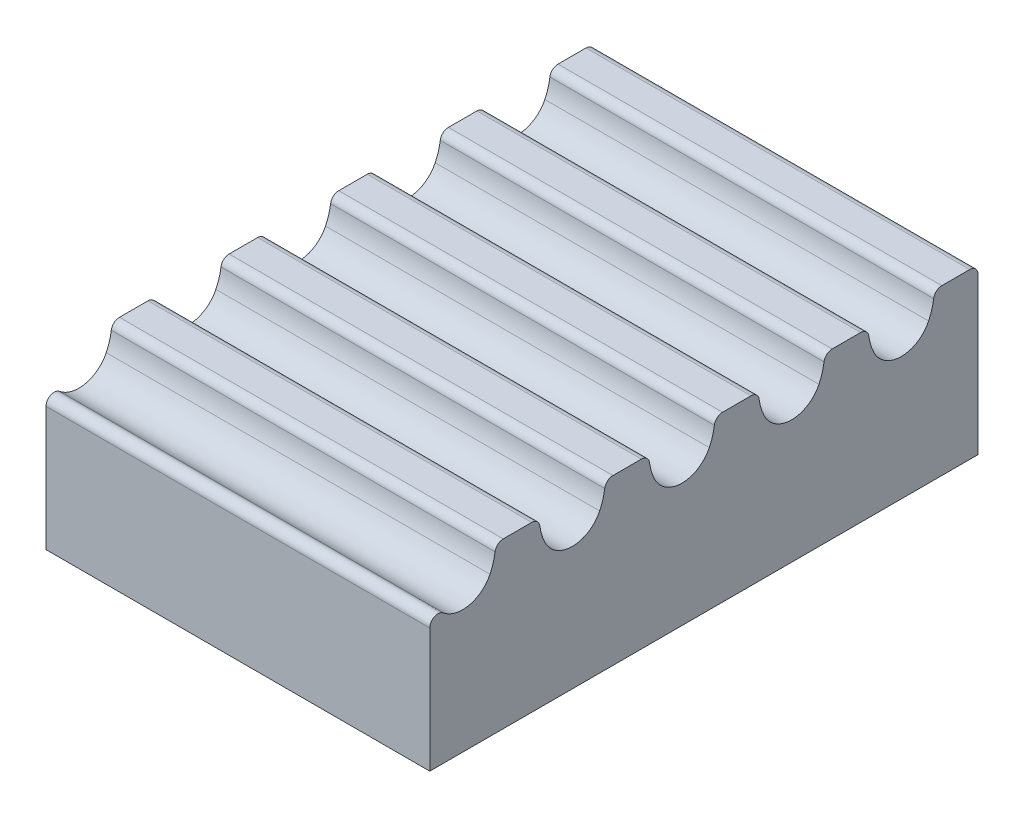
ISO-10303-21;
HEADER;
FILE_DESCRIPTION(('STEP AP214'),'2;1');
FILE_NAME('part.step','',(''),(''),'','','');
FILE_SCHEMA(('AUTOMOTIVE_DESIGN { 1 0 10303 214 1 1 1 1 }'));
ENDSEC;
DATA;
#1=APPLICATION_CONTEXT('core data for automotive mechanical design processes');
#2=APPLICATION_PROTOCOL_DEFINITION('international standard','automotive_design',2000,#1);
#3=PRODUCT_CONTEXT('',#1,'mechanical');
#4=PRODUCT('Part','Part','',(#3));
#5=PRODUCT_RELATED_PRODUCT_CATEGORY('part','',(#4));
#6=PRODUCT_DEFINITION_FORMATION('','',#4);
#7=PRODUCT_DEFINITION_CONTEXT('part definition',#1,'design');
#8=PRODUCT_DEFINITION('design','',#6,#7);
#9=PRODUCT_DEFINITION_SHAPE('','',#8);
#10=(LENGTH_UNIT() NAMED_UNIT(*) SI_UNIT(.MILLI.,.METRE.));
#11=(NAMED_UNIT(*) PLANE_ANGLE_UNIT() SI_UNIT($,.RADIAN.));
#12=(NAMED_UNIT(*) SI_UNIT($,.STERADIAN.) SOLID_ANGLE_UNIT());
#13=UNCERTAINTY_MEASURE_WITH_UNIT(LENGTH_MEASURE(1.E-05),#10,'distance_accuracy_value','');
#14=(GEOMETRIC_REPRESENTATION_CONTEXT(3) GLOBAL_UNCERTAINTY_ASSIGNED_CONTEXT((#13)) GLOBAL_UNIT_ASSIGNED_CONTEXT((#10,
#11,#12)) REPRESENTATION_CONTEXT('',''));
#15=CARTESIAN_POINT('',(0.,0.,0.));
#16=DIRECTION('',(0.,0.,1.));
#17=DIRECTION('',(1.,0.,0.));
#18=AXIS2_PLACEMENT_3D('',#15,#16,#17);
#19=CARTESIAN_POINT('',(7.,0.,0.));
#20=DIRECTION('',(0.,-1.,0.));
#21=DIRECTION('',(0.,0.,-1.));
#22=AXIS2_PLACEMENT_3D('',#19,#20,#21);
#23=PLANE('',#22);
#24=DIRECTION('',(0.,0.,1.));
#25=VECTOR('',#24,1.);
#26=CARTESIAN_POINT('',(7.,0.,0.));
#27=LINE('',#26,#25);
#28=CARTESIAN_POINT('',(7.,0.,-1.85982457490086));
#29=VERTEX_POINT('',#28);
#30=CARTESIAN_POINT('',(7.,0.,-1.34017542509914));
#31=VERTEX_POINT('',#30);
#32=EDGE_CURVE('E366',#29,#31,#27,.T.);
#33=ORIENTED_EDGE('',*,*,#32,.F.);
#34=DIRECTION('',(1.,0.,0.));
#35=VECTOR('',#34,1.);
#36=CARTESIAN_POINT('',(0.,0.,-1.85982457490086));
#37=LINE('',#36,#35);
#38=CARTESIAN_POINT('',(0.,0.,-1.85982457490086));
#39=VERTEX_POINT('',#38);
#40=EDGE_CURVE('E472',#29,#39,#37,.F.);
#41=ORIENTED_EDGE('',*,*,#40,.T.);
#42=DIRECTION('',(0.,0.,1.));
#43=VECTOR('',#42,1.);
#44=CARTESIAN_POINT('',(0.,0.,0.));
#45=LINE('',#44,#43);
#46=CARTESIAN_POINT('',(0.,0.,-1.34017542509914));
#47=VERTEX_POINT('',#46);
#48=EDGE_CURVE('E377',#39,#47,#45,.T.);
#49=ORIENTED_EDGE('',*,*,#48,.T.);
#50=DIRECTION('',(1.,0.,0.));
#51=VECTOR('',#50,1.);
#52=CARTESIAN_POINT('',(7.,0.,-1.34017542509914));
#53=LINE('',#52,#51);
#54=EDGE_CURVE('E470',#47,#31,#53,.T.);
#55=ORIENTED_EDGE('',*,*,#54,.T.);
#56=EDGE_LOOP('',(#33,#41,#49,#55));
#57=FACE_BOUND('',#56,.T.);
#58=ADVANCED_FACE('F36',(#57),#23,.F.);
#59=CARTESIAN_POINT('',(7.,0.,-3.85982457490086));
#60=VERTEX_POINT('',#59);
#61=CARTESIAN_POINT('',(7.,0.,-3.34017542509914));
#62=VERTEX_POINT('',#61);
#63=EDGE_CURVE('E367',#60,#62,#27,.T.);
#64=ORIENTED_EDGE('',*,*,#63,.F.);
#65=DIRECTION('',(1.,0.,0.));
#66=VECTOR('',#65,1.);
#67=CARTESIAN_POINT('',(0.,0.,-3.85982457490086));
#68=LINE('',#67,#66);
#69=CARTESIAN_POINT('',(0.,0.,-3.85982457490086));
#70=VERTEX_POINT('',#69);
#71=EDGE_CURVE('E462',#60,#70,#68,.F.);
#72=ORIENTED_EDGE('',*,*,#71,.T.);
#73=CARTESIAN_POINT('',(0.,0.,-3.34017542509914));
#74=VERTEX_POINT('',#73);
#75=EDGE_CURVE('E380',#70,#74,#45,.T.);
#76=ORIENTED_EDGE('',*,*,#75,.T.);
#77=DIRECTION('',(1.,0.,0.));
#78=VECTOR('',#77,1.);
#79=CARTESIAN_POINT('',(7.,0.,-3.34017542509914));
#80=LINE('',#79,#78);
#81=EDGE_CURVE('E59',#74,#62,#80,.T.);
#82=ORIENTED_EDGE('',*,*,#81,.T.);
#83=EDGE_LOOP('',(#64,#72,#76,#82));
#84=FACE_BOUND('',#83,.T.);
#85=ADVANCED_FACE('F555',(#84),#23,.F.);
#86=CARTESIAN_POINT('',(7.,0.,-5.85982457490086));
#87=VERTEX_POINT('',#86);
#88=CARTESIAN_POINT('',(7.,0.,-5.34017542509914));
#89=VERTEX_POINT('',#88);
#90=EDGE_CURVE('E369',#87,#89,#27,.T.);
#91=ORIENTED_EDGE('',*,*,#90,.F.);
#92=DIRECTION('',(1.,0.,0.));
#93=VECTOR('',#92,1.);
#94=CARTESIAN_POINT('',(0.,0.,-5.85982457490086));
#95=LINE('',#94,#93);
#96=CARTESIAN_POINT('',(0.,0.,-5.85982457490086));
#97=VERTEX_POINT('',#96);
#98=EDGE_CURVE('E453',#87,#97,#95,.F.);
#99=ORIENTED_EDGE('',*,*,#98,.T.);
#100=CARTESIAN_POINT('',(0.,0.,-5.34017542509914));
#101=VERTEX_POINT('',#100);
#102=EDGE_CURVE('E556',#97,#101,#45,.T.);
#103=ORIENTED_EDGE('',*,*,#102,.T.);
#104=DIRECTION('',(1.,0.,0.));
#105=VECTOR('',#104,1.);
#106=CARTESIAN_POINT('',(7.,0.,-5.34017542509914));
#107=LINE('',#106,#105);
#108=EDGE_CURVE('E451',#101,#89,#107,.T.);
#109=ORIENTED_EDGE('',*,*,#108,.T.);
#110=EDGE_LOOP('',(#91,#99,#103,#109));
#111=FACE_BOUND('',#110,.T.);
#112=ADVANCED_FACE('F583',(#111),#23,.F.);
#113=CARTESIAN_POINT('',(7.,0.,-7.85982457490086));
#114=VERTEX_POINT('',#113);
#115=CARTESIAN_POINT('',(7.,0.,-7.34017542509914));
#116=VERTEX_POINT('',#115);
#117=EDGE_CURVE('E518',#114,#116,#27,.T.);
#118=ORIENTED_EDGE('',*,*,#117,.F.);
#119=DIRECTION('',(1.,0.,0.));
#120=VECTOR('',#119,1.);
#121=CARTESIAN_POINT('',(0.,0.,-7.85982457490086));
#122=LINE('',#121,#120);
#123=CARTESIAN_POINT('',(0.,0.,-7.85982457490086));
#124=VERTEX_POINT('',#123);
#125=EDGE_CURVE('E443',#114,#124,#122,.F.);
#126=ORIENTED_EDGE('',*,*,#125,.T.);
#127=CARTESIAN_POINT('',(0.,0.,-7.34017542509914));
#128=VERTEX_POINT('',#127);
#129=EDGE_CURVE('E381',#124,#128,#45,.T.);
#130=ORIENTED_EDGE('',*,*,#129,.T.);
#131=DIRECTION('',(1.,0.,0.));
#132=VECTOR('',#131,1.);
#133=CARTESIAN_POINT('',(7.,0.,-7.34017542509914));
#134=LINE('',#133,#132);
#135=EDGE_CURVE('E441',#128,#116,#134,.T.);
#136=ORIENTED_EDGE('',*,*,#135,.T.);
#137=EDGE_LOOP('',(#118,#126,#130,#136));
#138=FACE_BOUND('',#137,.T.);
#139=ADVANCED_FACE('F564',(#138),#23,.F.);
#140=CARTESIAN_POINT('',(7.,0.,-9.85));
#141=VERTEX_POINT('',#140);
#142=CARTESIAN_POINT('',(7.,0.,-9.34017542509914));
#143=VERTEX_POINT('',#142);
#144=EDGE_CURVE('E370',#141,#143,#27,.T.);
#145=ORIENTED_EDGE('',*,*,#144,.F.);
#146=DIRECTION('',(-1.,0.,0.));
#147=VECTOR('',#146,1.);
#148=CARTESIAN_POINT('',(7.,0.,-9.85));
#149=LINE('',#148,#147);
#150=CARTESIAN_POINT('',(0.,0.,-9.85));
#151=VERTEX_POINT('',#150);
#152=EDGE_CURVE('E390',#141,#151,#149,.T.);
#153=ORIENTED_EDGE('',*,*,#152,.T.);
#154=CARTESIAN_POINT('',(0.,0.,-9.34017542509914));
#155=VERTEX_POINT('',#154);
#156=EDGE_CURVE('E362',#151,#155,#45,.T.);
#157=ORIENTED_EDGE('',*,*,#156,.T.);
#158=DIRECTION('',(1.,0.,0.));
#159=VECTOR('',#158,1.);
#160=CARTESIAN_POINT('',(7.,0.,-9.34017542509914));
#161=LINE('',#160,#159);
#162=EDGE_CURVE('E388',#155,#143,#161,.T.);
#163=ORIENTED_EDGE('',*,*,#162,.T.);
#164=EDGE_LOOP('',(#145,#153,#157,#163));
#165=FACE_BOUND('',#164,.T.);
#166=ADVANCED_FACE('F599',(#165),#23,.F.);
#167=CARTESIAN_POINT('',(7.,0.,0.));
#168=DIRECTION('',(0.,0.,-1.));
#169=DIRECTION('',(0.,1.,0.));
#170=AXIS2_PLACEMENT_3D('',#167,#168,#169);
#171=PLANE('',#170);
#172=DIRECTION('',(0.,-1.,0.));
#173=VECTOR('',#172,1.);
#174=CARTESIAN_POINT('',(7.,0.,0.));
#175=LINE('',#174,#173);
#176=CARTESIAN_POINT('',(7.,-0.737701575453767,0.));
#177=VERTEX_POINT('',#176);
#178=CARTESIAN_POINT('',(7.,-3.,0.));
#179=VERTEX_POINT('',#178);
#180=EDGE_CURVE('E359',#177,#179,#175,.T.);
#181=ORIENTED_EDGE('',*,*,#180,.F.);
#182=DIRECTION('',(1.,0.,0.));
#183=VECTOR('',#182,1.);
#184=CARTESIAN_POINT('',(0.,-0.737701575453767,0.));
#185=LINE('',#184,#183);
#186=CARTESIAN_POINT('',(0.,-0.737701575453767,0.));
#187=VERTEX_POINT('',#186);
#188=EDGE_CURVE('E44',#177,#187,#185,.F.);
#189=ORIENTED_EDGE('',*,*,#188,.T.);
#190=DIRECTION('',(0.,-1.,0.));
#191=VECTOR('',#190,1.);
#192=CARTESIAN_POINT('',(0.,0.,0.));
#193=LINE('',#192,#191);
#194=CARTESIAN_POINT('',(0.,-3.,0.));
#195=VERTEX_POINT('',#194);
#196=EDGE_CURVE('E358',#187,#195,#193,.T.);
#197=ORIENTED_EDGE('',*,*,#196,.T.);
#198=DIRECTION('',(-1.,0.,0.));
#199=VECTOR('',#198,1.);
#200=CARTESIAN_POINT('',(7.,-3.,0.));
#201=LINE('',#200,#199);
#202=EDGE_CURVE('E385',#179,#195,#201,.T.);
#203=ORIENTED_EDGE('',*,*,#202,.F.);
#204=EDGE_LOOP('',(#181,#189,#197,#203));
#205=FACE_BOUND('',#204,.T.);
#206=ADVANCED_FACE('F483',(#205),#171,.F.);
#207=CARTESIAN_POINT('',(7.,-3.,0.));
#208=DIRECTION('',(0.,1.,0.));
#209=DIRECTION('',(0.,0.,1.));
#210=AXIS2_PLACEMENT_3D('',#207,#208,#209);
#211=PLANE('',#210);
#212=DIRECTION('',(0.,0.,-1.));
#213=VECTOR('',#212,1.);
#214=CARTESIAN_POINT('',(0.,-3.,0.));
#215=LINE('',#214,#213);
#216=CARTESIAN_POINT('',(0.,-3.,-10.));
#217=VERTEX_POINT('',#216);
#218=EDGE_CURVE('E372',#195,#217,#215,.T.);
#219=ORIENTED_EDGE('',*,*,#218,.T.);
#220=DIRECTION('',(-1.,0.,0.));
#221=VECTOR('',#220,1.);
#222=CARTESIAN_POINT('',(7.,-3.,-10.));
#223=LINE('',#222,#221);
#224=CARTESIAN_POINT('',(7.,-3.,-10.));
#225=VERTEX_POINT('',#224);
#226=EDGE_CURVE('E382',#225,#217,#223,.T.);
#227=ORIENTED_EDGE('',*,*,#226,.F.);
#228=DIRECTION('',(0.,0.,-1.));
#229=VECTOR('',#228,1.);
#230=CARTESIAN_POINT('',(7.,-3.,0.));
#231=LINE('',#230,#229);
#232=EDGE_CURVE('E361',#179,#225,#231,.T.);
#233=ORIENTED_EDGE('',*,*,#232,.F.);
#234=ORIENTED_EDGE('',*,*,#202,.T.);
#235=EDGE_LOOP('',(#219,#227,#233,#234));
#236=FACE_BOUND('',#235,.T.);
#237=ADVANCED_FACE('F496',(#236),#211,.F.);
#238=CARTESIAN_POINT('',(7.,0.,-10.));
#239=DIRECTION('',(0.,0.,1.));
#240=DIRECTION('',(1.,0.,0.));
#241=AXIS2_PLACEMENT_3D('',#238,#239,#240);
#242=PLANE('',#241);
#243=DIRECTION('',(0.,1.,0.));
#244=VECTOR('',#243,1.);
#245=CARTESIAN_POINT('',(0.,0.,-10.));
#246=LINE('',#245,#244);
#247=CARTESIAN_POINT('',(0.,-0.15,-10.));
#248=VERTEX_POINT('',#247);
#249=EDGE_CURVE('E374',#217,#248,#246,.T.);
#250=ORIENTED_EDGE('',*,*,#249,.T.);
#251=DIRECTION('',(-1.,0.,0.));
#252=VECTOR('',#251,1.);
#253=CARTESIAN_POINT('',(7.,-0.15,-10.));
#254=LINE('',#253,#252);
#255=CARTESIAN_POINT('',(7.,-0.15,-10.));
#256=VERTEX_POINT('',#255);
#257=EDGE_CURVE('E415',#248,#256,#254,.F.);
#258=ORIENTED_EDGE('',*,*,#257,.T.);
#259=DIRECTION('',(0.,1.,0.));
#260=VECTOR('',#259,1.);
#261=CARTESIAN_POINT('',(7.,0.,-10.));
#262=LINE('',#261,#260);
#263=EDGE_CURVE('E364',#225,#256,#262,.T.);
#264=ORIENTED_EDGE('',*,*,#263,.F.);
#265=ORIENTED_EDGE('',*,*,#226,.T.);
#266=EDGE_LOOP('',(#250,#258,#264,#265));
#267=FACE_BOUND('',#266,.T.);
#268=ADVANCED_FACE('F618',(#267),#242,.F.);
#269=CARTESIAN_POINT('',(7.,0.,0.));
#270=DIRECTION('',(1.,0.,0.));
#271=DIRECTION('',(0.,0.,-1.));
#272=AXIS2_PLACEMENT_3D('',#269,#270,#271);
#273=PLANE('',#272);
#274=ORIENTED_EDGE('',*,*,#263,.T.);
#275=CARTESIAN_POINT('',(7.,-0.15,-9.85));
#276=DIRECTION('',(1.,0.,0.));
#277=DIRECTION('',(0.,0.,-1.));
#278=AXIS2_PLACEMENT_3D('',#275,#276,#277);
#279=CIRCLE('',#278,0.15);
#280=EDGE_CURVE('E436',#256,#141,#279,.T.);
#281=ORIENTED_EDGE('',*,*,#280,.T.);
#282=ORIENTED_EDGE('',*,*,#144,.T.);
#283=CARTESIAN_POINT('',(7.,-0.15,-9.34017542509914));
#284=DIRECTION('',(1.,0.,0.));
#285=DIRECTION('',(0.,0.,-1.));
#286=AXIS2_PLACEMENT_3D('',#283,#284,#285);
#287=CIRCLE('',#286,0.15);
#288=CARTESIAN_POINT('',(7.,-0.130434782608696,-9.19145689139056));
#289=VERTEX_POINT('',#288);
#290=EDGE_CURVE('E434',#143,#289,#287,.T.);
#291=ORIENTED_EDGE('',*,*,#290,.T.);
#292=CARTESIAN_POINT('',(7.,0.,-8.2));
#293=DIRECTION('',(1.,0.,0.));
#294=DIRECTION('',(0.,0.,-1.));
#295=AXIS2_PLACEMENT_3D('',#292,#293,#294);
#296=CIRCLE('',#295,1.);
#297=CARTESIAN_POINT('',(7.,-0.438202247191011,-9.09887640449438));
#298=VERTEX_POINT('',#297);
#299=EDGE_CURVE('E332',#298,#289,#296,.T.);
#300=ORIENTED_EDGE('',*,*,#299,.F.);
#301=CARTESIAN_POINT('',(7.,-0.195,-8.6));
#302=DIRECTION('',(1.,0.,0.));
#303=DIRECTION('',(0.,0.,-1.));
#304=AXIS2_PLACEMENT_3D('',#301,#302,#303);
#305=CIRCLE('',#304,0.555);
#306=CARTESIAN_POINT('',(7.,-0.438202247191011,-8.10112359550562));
#307=VERTEX_POINT('',#306);
#308=EDGE_CURVE('E329',#307,#298,#305,.T.);
#309=ORIENTED_EDGE('',*,*,#308,.F.);
#310=CARTESIAN_POINT('',(7.,0.,-9.));
#311=DIRECTION('',(1.,0.,0.));
#312=DIRECTION('',(0.,0.,-1.));
#313=AXIS2_PLACEMENT_3D('',#310,#311,#312);
#314=CIRCLE('',#313,1.);
#315=CARTESIAN_POINT('',(7.,-0.130434782608696,-8.00854310860945));
#316=VERTEX_POINT('',#315);
#317=EDGE_CURVE('E327',#316,#307,#314,.T.);
#318=ORIENTED_EDGE('',*,*,#317,.F.);
#319=CARTESIAN_POINT('',(7.,-0.15,-7.85982457490086));
#320=DIRECTION('',(1.,0.,0.));
#321=DIRECTION('',(0.,0.,-1.));
#322=AXIS2_PLACEMENT_3D('',#319,#320,#321);
#323=CIRCLE('',#322,0.15);
#324=EDGE_CURVE('E432',#316,#114,#323,.T.);
#325=ORIENTED_EDGE('',*,*,#324,.T.);
#326=ORIENTED_EDGE('',*,*,#117,.T.);
#327=CARTESIAN_POINT('',(7.,-0.15,-7.34017542509914));
#328=DIRECTION('',(1.,0.,0.));
#329=DIRECTION('',(0.,0.,-1.));
#330=AXIS2_PLACEMENT_3D('',#327,#328,#329);
#331=CIRCLE('',#330,0.15);
#332=CARTESIAN_POINT('',(7.,-0.130434782608696,-7.19145689139055));
#333=VERTEX_POINT('',#332);
#334=EDGE_CURVE('E430',#116,#333,#331,.T.);
#335=ORIENTED_EDGE('',*,*,#334,.T.);
#336=CARTESIAN_POINT('',(7.,0.,-6.2));
#337=DIRECTION('',(1.,0.,0.));
#338=DIRECTION('',(0.,0.,-1.));
#339=AXIS2_PLACEMENT_3D('',#336,#337,#338);
#340=CIRCLE('',#339,1.);
#341=CARTESIAN_POINT('',(7.,-0.438202247191011,-7.09887640449438));
#342=VERTEX_POINT('',#341);
#343=EDGE_CURVE('E312',#342,#333,#340,.T.);
#344=ORIENTED_EDGE('',*,*,#343,.F.);
#345=CARTESIAN_POINT('',(7.,-0.195,-6.6));
#346=DIRECTION('',(1.,0.,0.));
#347=DIRECTION('',(0.,0.,-1.));
#348=AXIS2_PLACEMENT_3D('',#345,#346,#347);
#349=CIRCLE('',#348,0.555);
#350=CARTESIAN_POINT('',(7.,-0.438202247191011,-6.10112359550562));
#351=VERTEX_POINT('',#350);
#352=EDGE_CURVE('E309',#351,#342,#349,.T.);
#353=ORIENTED_EDGE('',*,*,#352,.F.);
#354=CARTESIAN_POINT('',(7.,0.,-7.));
#355=DIRECTION('',(1.,0.,0.));
#356=DIRECTION('',(0.,0.,-1.));
#357=AXIS2_PLACEMENT_3D('',#354,#355,#356);
#358=CIRCLE('',#357,1.);
#359=CARTESIAN_POINT('',(7.,-0.130434782608696,-6.00854310860944));
#360=VERTEX_POINT('',#359);
#361=EDGE_CURVE('E307',#360,#351,#358,.T.);
#362=ORIENTED_EDGE('',*,*,#361,.F.);
#363=CARTESIAN_POINT('',(7.,-0.15,-5.85982457490086));
#364=DIRECTION('',(1.,0.,0.));
#365=DIRECTION('',(0.,0.,-1.));
#366=AXIS2_PLACEMENT_3D('',#363,#364,#365);
#367=CIRCLE('',#366,0.15);
#368=EDGE_CURVE('E428',#360,#87,#367,.T.);
#369=ORIENTED_EDGE('',*,*,#368,.T.);
#370=ORIENTED_EDGE('',*,*,#90,.T.);
#371=CARTESIAN_POINT('',(7.,-0.15,-5.34017542509914));
#372=DIRECTION('',(1.,0.,0.));
#373=DIRECTION('',(0.,0.,-1.));
#374=AXIS2_PLACEMENT_3D('',#371,#372,#373);
#375=CIRCLE('',#374,0.15);
#376=CARTESIAN_POINT('',(7.,-0.130434782608696,-5.19145689139055));
#377=VERTEX_POINT('',#376);
#378=EDGE_CURVE('E426',#89,#377,#375,.T.);
#379=ORIENTED_EDGE('',*,*,#378,.T.);
#380=CARTESIAN_POINT('',(7.,0.,-4.2));
#381=DIRECTION('',(1.,0.,0.));
#382=DIRECTION('',(0.,0.,-1.));
#383=AXIS2_PLACEMENT_3D('',#380,#381,#382);
#384=CIRCLE('',#383,1.);
#385=CARTESIAN_POINT('',(7.,-0.438202247191011,-5.09887640449438));
#386=VERTEX_POINT('',#385);
#387=EDGE_CURVE('E292',#386,#377,#384,.T.);
#388=ORIENTED_EDGE('',*,*,#387,.F.);
#389=CARTESIAN_POINT('',(7.,-0.195,-4.6));
#390=DIRECTION('',(1.,0.,0.));
#391=DIRECTION('',(0.,0.,-1.));
#392=AXIS2_PLACEMENT_3D('',#389,#390,#391);
#393=CIRCLE('',#392,0.555);
#394=CARTESIAN_POINT('',(7.,-0.438202247191011,-4.10112359550562));
#395=VERTEX_POINT('',#394);
#396=EDGE_CURVE('E289',#395,#386,#393,.T.);
#397=ORIENTED_EDGE('',*,*,#396,.F.);
#398=CARTESIAN_POINT('',(7.,0.,-5.));
#399=DIRECTION('',(1.,0.,0.));
#400=DIRECTION('',(0.,0.,-1.));
#401=AXIS2_PLACEMENT_3D('',#398,#399,#400);
#402=CIRCLE('',#401,1.);
#403=CARTESIAN_POINT('',(7.,-0.130434782608696,-4.00854310860944));
#404=VERTEX_POINT('',#403);
#405=EDGE_CURVE('E287',#404,#395,#402,.T.);
#406=ORIENTED_EDGE('',*,*,#405,.F.);
#407=CARTESIAN_POINT('',(7.,-0.15,-3.85982457490086));
#408=DIRECTION('',(1.,0.,0.));
#409=DIRECTION('',(0.,0.,-1.));
#410=AXIS2_PLACEMENT_3D('',#407,#408,#409);
#411=CIRCLE('',#410,0.15);
#412=EDGE_CURVE('E424',#404,#60,#411,.T.);
#413=ORIENTED_EDGE('',*,*,#412,.T.);
#414=ORIENTED_EDGE('',*,*,#63,.T.);
#415=CARTESIAN_POINT('',(7.,-0.15,-3.34017542509914));
#416=DIRECTION('',(1.,0.,0.));
#417=DIRECTION('',(0.,0.,-1.));
#418=AXIS2_PLACEMENT_3D('',#415,#416,#417);
#419=CIRCLE('',#418,0.15);
#420=CARTESIAN_POINT('',(7.,-0.130434782608696,-3.19145689139055));
#421=VERTEX_POINT('',#420);
#422=EDGE_CURVE('E51',#62,#421,#419,.T.);
#423=ORIENTED_EDGE('',*,*,#422,.T.);
#424=CARTESIAN_POINT('',(7.,0.,-2.2));
#425=DIRECTION('',(1.,0.,0.));
#426=DIRECTION('',(0.,0.,-1.));
#427=AXIS2_PLACEMENT_3D('',#424,#425,#426);
#428=CIRCLE('',#427,1.);
#429=CARTESIAN_POINT('',(7.,-0.438202247191011,-3.09887640449438));
#430=VERTEX_POINT('',#429);
#431=EDGE_CURVE('E276',#430,#421,#428,.T.);
#432=ORIENTED_EDGE('',*,*,#431,.F.);
#433=CARTESIAN_POINT('',(7.,-0.195,-2.6));
#434=DIRECTION('',(1.,0.,0.));
#435=DIRECTION('',(0.,0.,-1.));
#436=AXIS2_PLACEMENT_3D('',#433,#434,#435);
#437=CIRCLE('',#436,0.555);
#438=CARTESIAN_POINT('',(7.,-0.438202247191011,-2.10112359550562));
#439=VERTEX_POINT('',#438);
#440=EDGE_CURVE('E263',#439,#430,#437,.T.);
#441=ORIENTED_EDGE('',*,*,#440,.F.);
#442=CARTESIAN_POINT('',(7.,0.,-3.));
#443=DIRECTION('',(1.,0.,0.));
#444=DIRECTION('',(0.,0.,-1.));
#445=AXIS2_PLACEMENT_3D('',#442,#443,#444);
#446=CIRCLE('',#445,1.);
#447=CARTESIAN_POINT('',(7.,-0.130434782608696,-2.00854310860944));
#448=VERTEX_POINT('',#447);
#449=EDGE_CURVE('E253',#448,#439,#446,.T.);
#450=ORIENTED_EDGE('',*,*,#449,.F.);
#451=CARTESIAN_POINT('',(7.,-0.15,-1.85982457490086));
#452=DIRECTION('',(1.,0.,0.));
#453=DIRECTION('',(0.,0.,-1.));
#454=AXIS2_PLACEMENT_3D('',#451,#452,#453);
#455=CIRCLE('',#454,0.15);
#456=EDGE_CURVE('E421',#448,#29,#455,.T.);
#457=ORIENTED_EDGE('',*,*,#456,.T.);
#458=ORIENTED_EDGE('',*,*,#32,.T.);
#459=CARTESIAN_POINT('',(7.,-0.15,-1.34017542509914));
#460=DIRECTION('',(1.,0.,0.));
#461=DIRECTION('',(0.,0.,-1.));
#462=AXIS2_PLACEMENT_3D('',#459,#460,#461);
#463=CIRCLE('',#462,0.15);
#464=CARTESIAN_POINT('',(7.,-0.130434782608696,-1.19145689139056));
#465=VERTEX_POINT('',#464);
#466=EDGE_CURVE('E419',#31,#465,#463,.T.);
#467=ORIENTED_EDGE('',*,*,#466,.T.);
#468=CARTESIAN_POINT('',(7.,0.,-0.2));
#469=DIRECTION('',(1.,0.,0.));
#470=DIRECTION('',(0.,0.,-1.));
#471=AXIS2_PLACEMENT_3D('',#468,#469,#470);
#472=CIRCLE('',#471,1.);
#473=CARTESIAN_POINT('',(7.,-0.438202247191011,-1.09887640449438));
#474=VERTEX_POINT('',#473);
#475=EDGE_CURVE('E348',#474,#465,#472,.T.);
#476=ORIENTED_EDGE('',*,*,#475,.F.);
#477=CARTESIAN_POINT('',(7.,-0.195,-0.6));
#478=DIRECTION('',(1.,0.,0.));
#479=DIRECTION('',(0.,0.,-1.));
#480=AXIS2_PLACEMENT_3D('',#477,#478,#479);
#481=CIRCLE('',#480,0.555);
#482=CARTESIAN_POINT('',(7.,-0.622233155144455,-0.245744680851064));
#483=VERTEX_POINT('',#482);
#484=EDGE_CURVE('E346',#483,#474,#481,.T.);
#485=ORIENTED_EDGE('',*,*,#484,.F.);
#486=CARTESIAN_POINT('',(7.,-0.737701575453767,-0.15));
#487=DIRECTION('',(1.,0.,0.));
#488=DIRECTION('',(0.,0.,-1.));
#489=AXIS2_PLACEMENT_3D('',#486,#487,#488);
#490=CIRCLE('',#489,0.15);
#491=EDGE_CURVE('E417',#483,#177,#490,.T.);
#492=ORIENTED_EDGE('',*,*,#491,.T.);
#493=ORIENTED_EDGE('',*,*,#180,.T.);
#494=ORIENTED_EDGE('',*,*,#232,.T.);
#495=EDGE_LOOP('',(#274,#281,#282,#291,#300,#309,#318,#325,#326,#335,#344,#353,#362,#369,#370,
#379,#388,#397,#406,#413,#414,#423,#432,#441,#450,#457,#458,#467,#476,#485,#492,#493,#494));
#496=FACE_BOUND('',#495,.T.);
#497=ADVANCED_FACE('F275',(#496),#273,.T.);
#498=CARTESIAN_POINT('',(0.,0.,0.));
#499=DIRECTION('',(1.,0.,0.));
#500=DIRECTION('',(0.,0.,-1.));
#501=AXIS2_PLACEMENT_3D('',#498,#499,#500);
#502=PLANE('',#501);
#503=ORIENTED_EDGE('',*,*,#156,.F.);
#504=CARTESIAN_POINT('',(0.,-0.15,-9.85));
#505=DIRECTION('',(1.,0.,0.));
#506=DIRECTION('',(0.,0.,-1.));
#507=AXIS2_PLACEMENT_3D('',#504,#505,#506);
#508=CIRCLE('',#507,0.15);
#509=EDGE_CURVE('E413',#151,#248,#508,.F.);
#510=ORIENTED_EDGE('',*,*,#509,.T.);
#511=ORIENTED_EDGE('',*,*,#249,.F.);
#512=ORIENTED_EDGE('',*,*,#218,.F.);
#513=ORIENTED_EDGE('',*,*,#196,.F.);
#514=CARTESIAN_POINT('',(0.,-0.737701575453767,-0.15));
#515=DIRECTION('',(1.,0.,0.));
#516=DIRECTION('',(0.,0.,-1.));
#517=AXIS2_PLACEMENT_3D('',#514,#515,#516);
#518=CIRCLE('',#517,0.15);
#519=CARTESIAN_POINT('',(0.,-0.622233155144455,-0.245744680851064));
#520=VERTEX_POINT('',#519);
#521=EDGE_CURVE('E393',#187,#520,#518,.F.);
#522=ORIENTED_EDGE('',*,*,#521,.T.);
#523=CARTESIAN_POINT('',(0.,-0.195,-0.6));
#524=DIRECTION('',(1.,0.,0.));
#525=DIRECTION('',(0.,0.,-1.));
#526=AXIS2_PLACEMENT_3D('',#523,#524,#525);
#527=CIRCLE('',#526,0.555);
#528=CARTESIAN_POINT('',(0.,-0.438202247191011,-1.09887640449438));
#529=VERTEX_POINT('',#528);
#530=EDGE_CURVE('E271',#520,#529,#527,.T.);
#531=ORIENTED_EDGE('',*,*,#530,.T.);
#532=CARTESIAN_POINT('',(0.,0.,-0.2));
#533=DIRECTION('',(1.,0.,0.));
#534=DIRECTION('',(0.,0.,-1.));
#535=AXIS2_PLACEMENT_3D('',#532,#533,#534);
#536=CIRCLE('',#535,1.);
#537=CARTESIAN_POINT('',(0.,-0.130434782608696,-1.19145689139056));
#538=VERTEX_POINT('',#537);
#539=EDGE_CURVE('E349',#529,#538,#536,.T.);
#540=ORIENTED_EDGE('',*,*,#539,.T.);
#541=CARTESIAN_POINT('',(0.,-0.15,-1.34017542509914));
#542=DIRECTION('',(1.,0.,0.));
#543=DIRECTION('',(0.,0.,-1.));
#544=AXIS2_PLACEMENT_3D('',#541,#542,#543);
#545=CIRCLE('',#544,0.15);
#546=EDGE_CURVE('E395',#538,#47,#545,.F.);
#547=ORIENTED_EDGE('',*,*,#546,.T.);
#548=ORIENTED_EDGE('',*,*,#48,.F.);
#549=CARTESIAN_POINT('',(0.,-0.15,-1.85982457490086));
#550=DIRECTION('',(1.,0.,0.));
#551=DIRECTION('',(0.,0.,-1.));
#552=AXIS2_PLACEMENT_3D('',#549,#550,#551);
#553=CIRCLE('',#552,0.15);
#554=CARTESIAN_POINT('',(0.,-0.130434782608696,-2.00854310860944));
#555=VERTEX_POINT('',#554);
#556=EDGE_CURVE('E397',#39,#555,#553,.F.);
#557=ORIENTED_EDGE('',*,*,#556,.T.);
#558=CARTESIAN_POINT('',(0.,0.,-3.));
#559=DIRECTION('',(1.,0.,0.));
#560=DIRECTION('',(0.,0.,-1.));
#561=AXIS2_PLACEMENT_3D('',#558,#559,#560);
#562=CIRCLE('',#561,1.);
#563=CARTESIAN_POINT('',(0.,-0.438202247191011,-2.10112359550562));
#564=VERTEX_POINT('',#563);
#565=EDGE_CURVE('E280',#555,#564,#562,.T.);
#566=ORIENTED_EDGE('',*,*,#565,.T.);
#567=CARTESIAN_POINT('',(0.,-0.195,-2.6));
#568=DIRECTION('',(1.,0.,0.));
#569=DIRECTION('',(0.,0.,-1.));
#570=AXIS2_PLACEMENT_3D('',#567,#568,#569);
#571=CIRCLE('',#570,0.555);
#572=CARTESIAN_POINT('',(0.,-0.438202247191011,-3.09887640449438));
#573=VERTEX_POINT('',#572);
#574=EDGE_CURVE('E270',#564,#573,#571,.T.);
#575=ORIENTED_EDGE('',*,*,#574,.T.);
#576=CARTESIAN_POINT('',(0.,0.,-2.2));
#577=DIRECTION('',(1.,0.,0.));
#578=DIRECTION('',(0.,0.,-1.));
#579=AXIS2_PLACEMENT_3D('',#576,#577,#578);
#580=CIRCLE('',#579,1.);
#581=CARTESIAN_POINT('',(0.,-0.130434782608696,-3.19145689139055));
#582=VERTEX_POINT('',#581);
#583=EDGE_CURVE('E264',#573,#582,#580,.T.);
#584=ORIENTED_EDGE('',*,*,#583,.T.);
#585=CARTESIAN_POINT('',(0.,-0.15,-3.34017542509914));
#586=DIRECTION('',(1.,0.,0.));
#587=DIRECTION('',(0.,0.,-1.));
#588=AXIS2_PLACEMENT_3D('',#585,#586,#587);
#589=CIRCLE('',#588,0.15);
#590=EDGE_CURVE('E399',#582,#74,#589,.F.);
#591=ORIENTED_EDGE('',*,*,#590,.T.);
#592=ORIENTED_EDGE('',*,*,#75,.F.);
#593=CARTESIAN_POINT('',(0.,-0.15,-3.85982457490086));
#594=DIRECTION('',(1.,0.,0.));
#595=DIRECTION('',(0.,0.,-1.));
#596=AXIS2_PLACEMENT_3D('',#593,#594,#595);
#597=CIRCLE('',#596,0.15);
#598=CARTESIAN_POINT('',(0.,-0.130434782608696,-4.00854310860944));
#599=VERTEX_POINT('',#598);
#600=EDGE_CURVE('E401',#70,#599,#597,.F.);
#601=ORIENTED_EDGE('',*,*,#600,.T.);
#602=CARTESIAN_POINT('',(0.,0.,-5.));
#603=DIRECTION('',(1.,0.,0.));
#604=DIRECTION('',(0.,0.,-1.));
#605=AXIS2_PLACEMENT_3D('',#602,#603,#604);
#606=CIRCLE('',#605,1.);
#607=CARTESIAN_POINT('',(0.,-0.438202247191011,-4.10112359550562));
#608=VERTEX_POINT('',#607);
#609=EDGE_CURVE('E296',#599,#608,#606,.T.);
#610=ORIENTED_EDGE('',*,*,#609,.T.);
#611=CARTESIAN_POINT('',(0.,-0.195,-4.6));
#612=DIRECTION('',(1.,0.,0.));
#613=DIRECTION('',(0.,0.,-1.));
#614=AXIS2_PLACEMENT_3D('',#611,#612,#613);
#615=CIRCLE('',#614,0.555);
#616=CARTESIAN_POINT('',(0.,-0.438202247191011,-5.09887640449438));
#617=VERTEX_POINT('',#616);
#618=EDGE_CURVE('E298',#608,#617,#615,.T.);
#619=ORIENTED_EDGE('',*,*,#618,.T.);
#620=CARTESIAN_POINT('',(0.,0.,-4.2));
#621=DIRECTION('',(1.,0.,0.));
#622=DIRECTION('',(0.,0.,-1.));
#623=AXIS2_PLACEMENT_3D('',#620,#621,#622);
#624=CIRCLE('',#623,1.);
#625=CARTESIAN_POINT('',(0.,-0.130434782608696,-5.19145689139055));
#626=VERTEX_POINT('',#625);
#627=EDGE_CURVE('E290',#617,#626,#624,.T.);
#628=ORIENTED_EDGE('',*,*,#627,.T.);
#629=CARTESIAN_POINT('',(0.,-0.15,-5.34017542509914));
#630=DIRECTION('',(1.,0.,0.));
#631=DIRECTION('',(0.,0.,-1.));
#632=AXIS2_PLACEMENT_3D('',#629,#630,#631);
#633=CIRCLE('',#632,0.15);
#634=EDGE_CURVE('E403',#626,#101,#633,.F.);
#635=ORIENTED_EDGE('',*,*,#634,.T.);
#636=ORIENTED_EDGE('',*,*,#102,.F.);
#637=CARTESIAN_POINT('',(0.,-0.15,-5.85982457490086));
#638=DIRECTION('',(1.,0.,0.));
#639=DIRECTION('',(0.,0.,-1.));
#640=AXIS2_PLACEMENT_3D('',#637,#638,#639);
#641=CIRCLE('',#640,0.15);
#642=CARTESIAN_POINT('',(0.,-0.130434782608696,-6.00854310860944));
#643=VERTEX_POINT('',#642);
#644=EDGE_CURVE('E405',#97,#643,#641,.F.);
#645=ORIENTED_EDGE('',*,*,#644,.T.);
#646=CARTESIAN_POINT('',(0.,0.,-7.));
#647=DIRECTION('',(1.,0.,0.));
#648=DIRECTION('',(0.,0.,-1.));
#649=AXIS2_PLACEMENT_3D('',#646,#647,#648);
#650=CIRCLE('',#649,1.);
#651=CARTESIAN_POINT('',(0.,-0.438202247191011,-6.10112359550562));
#652=VERTEX_POINT('',#651);
#653=EDGE_CURVE('E316',#643,#652,#650,.T.);
#654=ORIENTED_EDGE('',*,*,#653,.T.);
#655=CARTESIAN_POINT('',(0.,-0.195,-6.6));
#656=DIRECTION('',(1.,0.,0.));
#657=DIRECTION('',(0.,0.,-1.));
#658=AXIS2_PLACEMENT_3D('',#655,#656,#657);
#659=CIRCLE('',#658,0.555);
#660=CARTESIAN_POINT('',(0.,-0.438202247191011,-7.09887640449438));
#661=VERTEX_POINT('',#660);
#662=EDGE_CURVE('E318',#652,#661,#659,.T.);
#663=ORIENTED_EDGE('',*,*,#662,.T.);
#664=CARTESIAN_POINT('',(0.,0.,-6.2));
#665=DIRECTION('',(1.,0.,0.));
#666=DIRECTION('',(0.,0.,-1.));
#667=AXIS2_PLACEMENT_3D('',#664,#665,#666);
#668=CIRCLE('',#667,1.);
#669=CARTESIAN_POINT('',(0.,-0.130434782608696,-7.19145689139055));
#670=VERTEX_POINT('',#669);
#671=EDGE_CURVE('E310',#661,#670,#668,.T.);
#672=ORIENTED_EDGE('',*,*,#671,.T.);
#673=CARTESIAN_POINT('',(0.,-0.15,-7.34017542509914));
#674=DIRECTION('',(1.,0.,0.));
#675=DIRECTION('',(0.,0.,-1.));
#676=AXIS2_PLACEMENT_3D('',#673,#674,#675);
#677=CIRCLE('',#676,0.15);
#678=EDGE_CURVE('E407',#670,#128,#677,.F.);
#679=ORIENTED_EDGE('',*,*,#678,.T.);
#680=ORIENTED_EDGE('',*,*,#129,.F.);
#681=CARTESIAN_POINT('',(0.,-0.15,-7.85982457490086));
#682=DIRECTION('',(1.,0.,0.));
#683=DIRECTION('',(0.,0.,-1.));
#684=AXIS2_PLACEMENT_3D('',#681,#682,#683);
#685=CIRCLE('',#684,0.15);
#686=CARTESIAN_POINT('',(0.,-0.130434782608696,-8.00854310860945));
#687=VERTEX_POINT('',#686);
#688=EDGE_CURVE('E409',#124,#687,#685,.F.);
#689=ORIENTED_EDGE('',*,*,#688,.T.);
#690=CARTESIAN_POINT('',(0.,0.,-9.));
#691=DIRECTION('',(1.,0.,0.));
#692=DIRECTION('',(0.,0.,-1.));
#693=AXIS2_PLACEMENT_3D('',#690,#691,#692);
#694=CIRCLE('',#693,1.);
#695=CARTESIAN_POINT('',(0.,-0.438202247191011,-8.10112359550562));
#696=VERTEX_POINT('',#695);
#697=EDGE_CURVE('E336',#687,#696,#694,.T.);
#698=ORIENTED_EDGE('',*,*,#697,.T.);
#699=CARTESIAN_POINT('',(0.,-0.195,-8.6));
#700=DIRECTION('',(1.,0.,0.));
#701=DIRECTION('',(0.,0.,-1.));
#702=AXIS2_PLACEMENT_3D('',#699,#700,#701);
#703=CIRCLE('',#702,0.555);
#704=CARTESIAN_POINT('',(0.,-0.438202247191011,-9.09887640449438));
#705=VERTEX_POINT('',#704);
#706=EDGE_CURVE('E338',#696,#705,#703,.T.);
#707=ORIENTED_EDGE('',*,*,#706,.T.);
#708=CARTESIAN_POINT('',(0.,0.,-8.2));
#709=DIRECTION('',(1.,0.,0.));
#710=DIRECTION('',(0.,0.,-1.));
#711=AXIS2_PLACEMENT_3D('',#708,#709,#710);
#712=CIRCLE('',#711,1.);
#713=CARTESIAN_POINT('',(0.,-0.130434782608696,-9.19145689139056));
#714=VERTEX_POINT('',#713);
#715=EDGE_CURVE('E330',#705,#714,#712,.T.);
#716=ORIENTED_EDGE('',*,*,#715,.T.);
#717=CARTESIAN_POINT('',(0.,-0.15,-9.34017542509914));
#718=DIRECTION('',(1.,0.,0.));
#719=DIRECTION('',(0.,0.,-1.));
#720=AXIS2_PLACEMENT_3D('',#717,#718,#719);
#721=CIRCLE('',#720,0.15);
#722=EDGE_CURVE('E411',#714,#155,#721,.F.);
#723=ORIENTED_EDGE('',*,*,#722,.T.);
#724=EDGE_LOOP('',(#503,#510,#511,#512,#513,#522,#531,#540,#547,#548,#557,#566,#575,#584,#591,
#592,#601,#610,#619,#628,#635,#636,#645,#654,#663,#672,#679,#680,#689,#698,#707,#716,#723));
#725=FACE_BOUND('',#724,.T.);
#726=ADVANCED_FACE('F490',(#725),#502,.F.);
#727=CARTESIAN_POINT('',(7.,-0.195,-0.6));
#728=DIRECTION('',(-1.,0.,0.));
#729=DIRECTION('',(0.,0.,1.));
#730=AXIS2_PLACEMENT_3D('',#727,#728,#729);
#731=CYLINDRICAL_SURFACE('',#730,0.555);
#732=ORIENTED_EDGE('',*,*,#530,.F.);
#733=DIRECTION('',(-1.,0.,0.));
#734=VECTOR('',#733,1.);
#735=CARTESIAN_POINT('',(7.,-0.622233155144455,-0.245744680851064));
#736=LINE('',#735,#734);
#737=EDGE_CURVE('E11',#520,#483,#736,.F.);
#738=ORIENTED_EDGE('',*,*,#737,.T.);
#739=ORIENTED_EDGE('',*,*,#484,.T.);
#740=DIRECTION('',(-1.,0.,0.));
#741=VECTOR('',#740,1.);
#742=CARTESIAN_POINT('',(7.,-0.438202247191011,-1.09887640449438));
#743=LINE('',#742,#741);
#744=EDGE_CURVE('E352',#474,#529,#743,.T.);
#745=ORIENTED_EDGE('',*,*,#744,.T.);
#746=EDGE_LOOP('',(#732,#738,#739,#745));
#747=FACE_BOUND('',#746,.T.);
#748=ADVANCED_FACE('F503',(#747),#731,.F.);
#749=CARTESIAN_POINT('',(7.,0.,-0.2));
#750=DIRECTION('',(-1.,0.,0.));
#751=DIRECTION('',(0.,0.,1.));
#752=AXIS2_PLACEMENT_3D('',#749,#750,#751);
#753=CYLINDRICAL_SURFACE('',#752,1.);
#754=ORIENTED_EDGE('',*,*,#475,.T.);
#755=DIRECTION('',(-1.,0.,0.));
#756=VECTOR('',#755,1.);
#757=CARTESIAN_POINT('',(7.,-0.130434782608696,-1.19145689139056));
#758=LINE('',#757,#756);
#759=EDGE_CURVE('E476',#465,#538,#758,.T.);
#760=ORIENTED_EDGE('',*,*,#759,.T.);
#761=ORIENTED_EDGE('',*,*,#539,.F.);
#762=ORIENTED_EDGE('',*,*,#744,.F.);
#763=EDGE_LOOP('',(#754,#760,#761,#762));
#764=FACE_BOUND('',#763,.T.);
#765=ADVANCED_FACE('F508',(#764),#753,.F.);
#766=CARTESIAN_POINT('',(7.,0.,-9.));
#767=DIRECTION('',(-1.,0.,0.));
#768=DIRECTION('',(0.,0.,1.));
#769=AXIS2_PLACEMENT_3D('',#766,#767,#768);
#770=CYLINDRICAL_SURFACE('',#769,1.);
#771=ORIENTED_EDGE('',*,*,#697,.F.);
#772=DIRECTION('',(-1.,0.,0.));
#773=VECTOR('',#772,1.);
#774=CARTESIAN_POINT('',(7.,-0.130434782608696,-8.00854310860945));
#775=LINE('',#774,#773);
#776=EDGE_CURVE('E446',#687,#316,#775,.F.);
#777=ORIENTED_EDGE('',*,*,#776,.T.);
#778=ORIENTED_EDGE('',*,*,#317,.T.);
#779=DIRECTION('',(-1.,0.,0.));
#780=VECTOR('',#779,1.);
#781=CARTESIAN_POINT('',(7.,-0.438202247191011,-8.10112359550562));
#782=LINE('',#781,#780);
#783=EDGE_CURVE('E319',#307,#696,#782,.T.);
#784=ORIENTED_EDGE('',*,*,#783,.T.);
#785=EDGE_LOOP('',(#771,#777,#778,#784));
#786=FACE_BOUND('',#785,.T.);
#787=ADVANCED_FACE('F781',(#786),#770,.F.);
#788=CARTESIAN_POINT('',(7.,-0.195,-8.6));
#789=DIRECTION('',(-1.,0.,0.));
#790=DIRECTION('',(0.,0.,1.));
#791=AXIS2_PLACEMENT_3D('',#788,#789,#790);
#792=CYLINDRICAL_SURFACE('',#791,0.555);
#793=ORIENTED_EDGE('',*,*,#706,.F.);
#794=ORIENTED_EDGE('',*,*,#783,.F.);
#795=ORIENTED_EDGE('',*,*,#308,.T.);
#796=DIRECTION('',(-1.,0.,0.));
#797=VECTOR('',#796,1.);
#798=CARTESIAN_POINT('',(7.,-0.438202247191011,-9.09887640449438));
#799=LINE('',#798,#797);
#800=EDGE_CURVE('E335',#298,#705,#799,.T.);
#801=ORIENTED_EDGE('',*,*,#800,.T.);
#802=EDGE_LOOP('',(#793,#794,#795,#801));
#803=FACE_BOUND('',#802,.T.);
#804=ADVANCED_FACE('F594',(#803),#792,.F.);
#805=CARTESIAN_POINT('',(7.,0.,-8.2));
#806=DIRECTION('',(-1.,0.,0.));
#807=DIRECTION('',(0.,0.,1.));
#808=AXIS2_PLACEMENT_3D('',#805,#806,#807);
#809=CYLINDRICAL_SURFACE('',#808,1.);
#810=ORIENTED_EDGE('',*,*,#299,.T.);
#811=DIRECTION('',(-1.,0.,0.));
#812=VECTOR('',#811,1.);
#813=CARTESIAN_POINT('',(7.,-0.130434782608696,-9.19145689139056));
#814=LINE('',#813,#812);
#815=EDGE_CURVE('E438',#289,#714,#814,.T.);
#816=ORIENTED_EDGE('',*,*,#815,.T.);
#817=ORIENTED_EDGE('',*,*,#715,.F.);
#818=ORIENTED_EDGE('',*,*,#800,.F.);
#819=EDGE_LOOP('',(#810,#816,#817,#818));
#820=FACE_BOUND('',#819,.T.);
#821=ADVANCED_FACE('F587',(#820),#809,.F.);
#822=CARTESIAN_POINT('',(7.,0.,-7.));
#823=DIRECTION('',(-1.,0.,0.));
#824=DIRECTION('',(0.,0.,1.));
#825=AXIS2_PLACEMENT_3D('',#822,#823,#824);
#826=CYLINDRICAL_SURFACE('',#825,1.);
#827=ORIENTED_EDGE('',*,*,#653,.F.);
#828=DIRECTION('',(-1.,0.,0.));
#829=VECTOR('',#828,1.);
#830=CARTESIAN_POINT('',(7.,-0.130434782608696,-6.00854310860944));
#831=LINE('',#830,#829);
#832=EDGE_CURVE('E456',#643,#360,#831,.F.);
#833=ORIENTED_EDGE('',*,*,#832,.T.);
#834=ORIENTED_EDGE('',*,*,#361,.T.);
#835=DIRECTION('',(-1.,0.,0.));
#836=VECTOR('',#835,1.);
#837=CARTESIAN_POINT('',(7.,-0.438202247191011,-6.10112359550562));
#838=LINE('',#837,#836);
#839=EDGE_CURVE('E299',#351,#652,#838,.T.);
#840=ORIENTED_EDGE('',*,*,#839,.T.);
#841=EDGE_LOOP('',(#827,#833,#834,#840));
#842=FACE_BOUND('',#841,.T.);
#843=ADVANCED_FACE('F585',(#842),#826,.F.);
#844=CARTESIAN_POINT('',(7.,-0.195,-6.6));
#845=DIRECTION('',(-1.,0.,0.));
#846=DIRECTION('',(0.,0.,1.));
#847=AXIS2_PLACEMENT_3D('',#844,#845,#846);
#848=CYLINDRICAL_SURFACE('',#847,0.555);
#849=ORIENTED_EDGE('',*,*,#662,.F.);
#850=ORIENTED_EDGE('',*,*,#839,.F.);
#851=ORIENTED_EDGE('',*,*,#352,.T.);
#852=DIRECTION('',(-1.,0.,0.));
#853=VECTOR('',#852,1.);
#854=CARTESIAN_POINT('',(7.,-0.438202247191011,-7.09887640449438));
#855=LINE('',#854,#853);
#856=EDGE_CURVE('E315',#342,#661,#855,.T.);
#857=ORIENTED_EDGE('',*,*,#856,.T.);
#858=EDGE_LOOP('',(#849,#850,#851,#857));
#859=FACE_BOUND('',#858,.T.);
#860=ADVANCED_FACE('F577',(#859),#848,.F.);
#861=CARTESIAN_POINT('',(7.,0.,-6.2));
#862=DIRECTION('',(-1.,0.,0.));
#863=DIRECTION('',(0.,0.,1.));
#864=AXIS2_PLACEMENT_3D('',#861,#862,#863);
#865=CYLINDRICAL_SURFACE('',#864,1.);
#866=ORIENTED_EDGE('',*,*,#343,.T.);
#867=DIRECTION('',(-1.,0.,0.));
#868=VECTOR('',#867,1.);
#869=CARTESIAN_POINT('',(7.,-0.130434782608696,-7.19145689139055));
#870=LINE('',#869,#868);
#871=EDGE_CURVE('E448',#333,#670,#870,.T.);
#872=ORIENTED_EDGE('',*,*,#871,.T.);
#873=ORIENTED_EDGE('',*,*,#671,.F.);
#874=ORIENTED_EDGE('',*,*,#856,.F.);
#875=EDGE_LOOP('',(#866,#872,#873,#874));
#876=FACE_BOUND('',#875,.T.);
#877=ADVANCED_FACE('F573',(#876),#865,.F.);
#878=CARTESIAN_POINT('',(7.,0.,-5.));
#879=DIRECTION('',(-1.,0.,0.));
#880=DIRECTION('',(0.,0.,1.));
#881=AXIS2_PLACEMENT_3D('',#878,#879,#880);
#882=CYLINDRICAL_SURFACE('',#881,1.);
#883=ORIENTED_EDGE('',*,*,#609,.F.);
#884=DIRECTION('',(-1.,0.,0.));
#885=VECTOR('',#884,1.);
#886=CARTESIAN_POINT('',(7.,-0.130434782608696,-4.00854310860944));
#887=LINE('',#886,#885);
#888=EDGE_CURVE('E465',#599,#404,#887,.F.);
#889=ORIENTED_EDGE('',*,*,#888,.T.);
#890=ORIENTED_EDGE('',*,*,#405,.T.);
#891=DIRECTION('',(-1.,0.,0.));
#892=VECTOR('',#891,1.);
#893=CARTESIAN_POINT('',(7.,-0.438202247191011,-4.10112359550562));
#894=LINE('',#893,#892);
#895=EDGE_CURVE('E282',#395,#608,#894,.T.);
#896=ORIENTED_EDGE('',*,*,#895,.T.);
#897=EDGE_LOOP('',(#883,#889,#890,#896));
#898=FACE_BOUND('',#897,.T.);
#899=ADVANCED_FACE('F751',(#898),#882,.F.);
#900=CARTESIAN_POINT('',(7.,-0.195,-4.6));
#901=DIRECTION('',(-1.,0.,0.));
#902=DIRECTION('',(0.,0.,1.));
#903=AXIS2_PLACEMENT_3D('',#900,#901,#902);
#904=CYLINDRICAL_SURFACE('',#903,0.555);
#905=ORIENTED_EDGE('',*,*,#618,.F.);
#906=ORIENTED_EDGE('',*,*,#895,.F.);
#907=ORIENTED_EDGE('',*,*,#396,.T.);
#908=DIRECTION('',(-1.,0.,0.));
#909=VECTOR('',#908,1.);
#910=CARTESIAN_POINT('',(7.,-0.438202247191011,-5.09887640449438));
#911=LINE('',#910,#909);
#912=EDGE_CURVE('E295',#386,#617,#911,.T.);
#913=ORIENTED_EDGE('',*,*,#912,.T.);
#914=EDGE_LOOP('',(#905,#906,#907,#913));
#915=FACE_BOUND('',#914,.T.);
#916=ADVANCED_FACE('F545',(#915),#904,.F.);
#917=CARTESIAN_POINT('',(7.,0.,-4.2));
#918=DIRECTION('',(-1.,0.,0.));
#919=DIRECTION('',(0.,0.,1.));
#920=AXIS2_PLACEMENT_3D('',#917,#918,#919);
#921=CYLINDRICAL_SURFACE('',#920,1.);
#922=ORIENTED_EDGE('',*,*,#387,.T.);
#923=DIRECTION('',(-1.,0.,0.));
#924=VECTOR('',#923,1.);
#925=CARTESIAN_POINT('',(7.,-0.130434782608696,-5.19145689139055));
#926=LINE('',#925,#924);
#927=EDGE_CURVE('E458',#377,#626,#926,.T.);
#928=ORIENTED_EDGE('',*,*,#927,.T.);
#929=ORIENTED_EDGE('',*,*,#627,.F.);
#930=ORIENTED_EDGE('',*,*,#912,.F.);
#931=EDGE_LOOP('',(#922,#928,#929,#930));
#932=FACE_BOUND('',#931,.T.);
#933=ADVANCED_FACE('F537',(#932),#921,.F.);
#934=CARTESIAN_POINT('',(7.,0.,-3.));
#935=DIRECTION('',(-1.,0.,0.));
#936=DIRECTION('',(0.,0.,1.));
#937=AXIS2_PLACEMENT_3D('',#934,#935,#936);
#938=CYLINDRICAL_SURFACE('',#937,1.);
#939=ORIENTED_EDGE('',*,*,#565,.F.);
#940=DIRECTION('',(-1.,0.,0.));
#941=VECTOR('',#940,1.);
#942=CARTESIAN_POINT('',(7.,-0.130434782608696,-2.00854310860944));
#943=LINE('',#942,#941);
#944=EDGE_CURVE('E260',#555,#448,#943,.F.);
#945=ORIENTED_EDGE('',*,*,#944,.T.);
#946=ORIENTED_EDGE('',*,*,#449,.T.);
#947=DIRECTION('',(-1.,0.,0.));
#948=VECTOR('',#947,1.);
#949=CARTESIAN_POINT('',(7.,-0.438202247191011,-2.10112359550562));
#950=LINE('',#949,#948);
#951=EDGE_CURVE('E257',#439,#564,#950,.T.);
#952=ORIENTED_EDGE('',*,*,#951,.T.);
#953=EDGE_LOOP('',(#939,#945,#946,#952));
#954=FACE_BOUND('',#953,.T.);
#955=ADVANCED_FACE('F256',(#954),#938,.F.);
#956=CARTESIAN_POINT('',(7.,-0.195,-2.6));
#957=DIRECTION('',(-1.,0.,0.));
#958=DIRECTION('',(0.,0.,1.));
#959=AXIS2_PLACEMENT_3D('',#956,#957,#958);
#960=CYLINDRICAL_SURFACE('',#959,0.555);
#961=ORIENTED_EDGE('',*,*,#574,.F.);
#962=ORIENTED_EDGE('',*,*,#951,.F.);
#963=ORIENTED_EDGE('',*,*,#440,.T.);
#964=DIRECTION('',(-1.,0.,0.));
#965=VECTOR('',#964,1.);
#966=CARTESIAN_POINT('',(7.,-0.438202247191011,-3.09887640449438));
#967=LINE('',#966,#965);
#968=EDGE_CURVE('E272',#430,#573,#967,.T.);
#969=ORIENTED_EDGE('',*,*,#968,.T.);
#970=EDGE_LOOP('',(#961,#962,#963,#969));
#971=FACE_BOUND('',#970,.T.);
#972=ADVANCED_FACE('F267',(#971),#960,.F.);
#973=CARTESIAN_POINT('',(7.,0.,-2.2));
#974=DIRECTION('',(-1.,0.,0.));
#975=DIRECTION('',(0.,0.,1.));
#976=AXIS2_PLACEMENT_3D('',#973,#974,#975);
#977=CYLINDRICAL_SURFACE('',#976,1.);
#978=ORIENTED_EDGE('',*,*,#431,.T.);
#979=DIRECTION('',(-1.,0.,0.));
#980=VECTOR('',#979,1.);
#981=CARTESIAN_POINT('',(7.,-0.130434782608696,-3.19145689139055));
#982=LINE('',#981,#980);
#983=EDGE_CURVE('E467',#421,#582,#982,.T.);
#984=ORIENTED_EDGE('',*,*,#983,.T.);
#985=ORIENTED_EDGE('',*,*,#583,.F.);
#986=ORIENTED_EDGE('',*,*,#968,.F.);
#987=EDGE_LOOP('',(#978,#984,#985,#986));
#988=FACE_BOUND('',#987,.T.);
#989=ADVANCED_FACE('F630',(#988),#977,.F.);
#990=CARTESIAN_POINT('',(7.,-0.15,-9.85));
#991=DIRECTION('',(-1.,0.,0.));
#992=DIRECTION('',(0.,0.,1.));
#993=AXIS2_PLACEMENT_3D('',#990,#991,#992);
#994=CYLINDRICAL_SURFACE('',#993,0.15);
#995=ORIENTED_EDGE('',*,*,#280,.F.);
#996=ORIENTED_EDGE('',*,*,#257,.F.);
#997=ORIENTED_EDGE('',*,*,#509,.F.);
#998=ORIENTED_EDGE('',*,*,#152,.F.);
#999=EDGE_LOOP('',(#995,#996,#997,#998));
#1000=FACE_BOUND('',#999,.T.);
#1001=ADVANCED_FACE('F615',(#1000),#994,.T.);
#1002=CARTESIAN_POINT('',(7.,-0.15,-9.34017542509914));
#1003=DIRECTION('',(-1.,0.,0.));
#1004=DIRECTION('',(0.,0.,1.));
#1005=AXIS2_PLACEMENT_3D('',#1002,#1003,#1004);
#1006=CYLINDRICAL_SURFACE('',#1005,0.15);
#1007=ORIENTED_EDGE('',*,*,#290,.F.);
#1008=ORIENTED_EDGE('',*,*,#162,.F.);
#1009=ORIENTED_EDGE('',*,*,#722,.F.);
#1010=ORIENTED_EDGE('',*,*,#815,.F.);
#1011=EDGE_LOOP('',(#1007,#1008,#1009,#1010));
#1012=FACE_BOUND('',#1011,.T.);
#1013=ADVANCED_FACE('F629',(#1012),#1006,.T.);
#1014=CARTESIAN_POINT('',(7.,-0.15,-7.85982457490086));
#1015=DIRECTION('',(-1.,0.,0.));
#1016=DIRECTION('',(0.,0.,1.));
#1017=AXIS2_PLACEMENT_3D('',#1014,#1015,#1016);
#1018=CYLINDRICAL_SURFACE('',#1017,0.15);
#1019=ORIENTED_EDGE('',*,*,#324,.F.);
#1020=ORIENTED_EDGE('',*,*,#776,.F.);
#1021=ORIENTED_EDGE('',*,*,#688,.F.);
#1022=ORIENTED_EDGE('',*,*,#125,.F.);
#1023=EDGE_LOOP('',(#1019,#1020,#1021,#1022));
#1024=FACE_BOUND('',#1023,.T.);
#1025=ADVANCED_FACE('F633',(#1024),#1018,.T.);
#1026=CARTESIAN_POINT('',(7.,-0.15,-7.34017542509914));
#1027=DIRECTION('',(-1.,0.,0.));
#1028=DIRECTION('',(0.,0.,1.));
#1029=AXIS2_PLACEMENT_3D('',#1026,#1027,#1028);
#1030=CYLINDRICAL_SURFACE('',#1029,0.15);
#1031=ORIENTED_EDGE('',*,*,#334,.F.);
#1032=ORIENTED_EDGE('',*,*,#135,.F.);
#1033=ORIENTED_EDGE('',*,*,#678,.F.);
#1034=ORIENTED_EDGE('',*,*,#871,.F.);
#1035=EDGE_LOOP('',(#1031,#1032,#1033,#1034));
#1036=FACE_BOUND('',#1035,.T.);
#1037=ADVANCED_FACE('F567',(#1036),#1030,.T.);
#1038=CARTESIAN_POINT('',(7.,-0.15,-5.85982457490086));
#1039=DIRECTION('',(-1.,0.,0.));
#1040=DIRECTION('',(0.,0.,1.));
#1041=AXIS2_PLACEMENT_3D('',#1038,#1039,#1040);
#1042=CYLINDRICAL_SURFACE('',#1041,0.15);
#1043=ORIENTED_EDGE('',*,*,#368,.F.);
#1044=ORIENTED_EDGE('',*,*,#832,.F.);
#1045=ORIENTED_EDGE('',*,*,#644,.F.);
#1046=ORIENTED_EDGE('',*,*,#98,.F.);
#1047=EDGE_LOOP('',(#1043,#1044,#1045,#1046));
#1048=FACE_BOUND('',#1047,.T.);
#1049=ADVANCED_FACE('F582',(#1048),#1042,.T.);
#1050=CARTESIAN_POINT('',(7.,-0.15,-5.34017542509914));
#1051=DIRECTION('',(-1.,0.,0.));
#1052=DIRECTION('',(0.,0.,1.));
#1053=AXIS2_PLACEMENT_3D('',#1050,#1051,#1052);
#1054=CYLINDRICAL_SURFACE('',#1053,0.15);
#1055=ORIENTED_EDGE('',*,*,#378,.F.);
#1056=ORIENTED_EDGE('',*,*,#108,.F.);
#1057=ORIENTED_EDGE('',*,*,#634,.F.);
#1058=ORIENTED_EDGE('',*,*,#927,.F.);
#1059=EDGE_LOOP('',(#1055,#1056,#1057,#1058));
#1060=FACE_BOUND('',#1059,.T.);
#1061=ADVANCED_FACE('F534',(#1060),#1054,.T.);
#1062=CARTESIAN_POINT('',(7.,-0.15,-3.85982457490086));
#1063=DIRECTION('',(-1.,0.,0.));
#1064=DIRECTION('',(0.,0.,1.));
#1065=AXIS2_PLACEMENT_3D('',#1062,#1063,#1064);
#1066=CYLINDRICAL_SURFACE('',#1065,0.15);
#1067=ORIENTED_EDGE('',*,*,#412,.F.);
#1068=ORIENTED_EDGE('',*,*,#888,.F.);
#1069=ORIENTED_EDGE('',*,*,#600,.F.);
#1070=ORIENTED_EDGE('',*,*,#71,.F.);
#1071=EDGE_LOOP('',(#1067,#1068,#1069,#1070));
#1072=FACE_BOUND('',#1071,.T.);
#1073=ADVANCED_FACE('F553',(#1072),#1066,.T.);
#1074=CARTESIAN_POINT('',(7.,-0.15,-3.34017542509914));
#1075=DIRECTION('',(-1.,0.,0.));
#1076=DIRECTION('',(0.,0.,1.));
#1077=AXIS2_PLACEMENT_3D('',#1074,#1075,#1076);
#1078=CYLINDRICAL_SURFACE('',#1077,0.15);
#1079=ORIENTED_EDGE('',*,*,#422,.F.);
#1080=ORIENTED_EDGE('',*,*,#81,.F.);
#1081=ORIENTED_EDGE('',*,*,#590,.F.);
#1082=ORIENTED_EDGE('',*,*,#983,.F.);
#1083=EDGE_LOOP('',(#1079,#1080,#1081,#1082));
#1084=FACE_BOUND('',#1083,.T.);
#1085=ADVANCED_FACE('F646',(#1084),#1078,.T.);
#1086=CARTESIAN_POINT('',(7.,-0.15,-1.85982457490086));
#1087=DIRECTION('',(-1.,0.,0.));
#1088=DIRECTION('',(0.,0.,1.));
#1089=AXIS2_PLACEMENT_3D('',#1086,#1087,#1088);
#1090=CYLINDRICAL_SURFACE('',#1089,0.15);
#1091=ORIENTED_EDGE('',*,*,#456,.F.);
#1092=ORIENTED_EDGE('',*,*,#944,.F.);
#1093=ORIENTED_EDGE('',*,*,#556,.F.);
#1094=ORIENTED_EDGE('',*,*,#40,.F.);
#1095=EDGE_LOOP('',(#1091,#1092,#1093,#1094));
#1096=FACE_BOUND('',#1095,.T.);
#1097=ADVANCED_FACE('F649',(#1096),#1090,.T.);
#1098=CARTESIAN_POINT('',(7.,-0.15,-1.34017542509914));
#1099=DIRECTION('',(-1.,0.,0.));
#1100=DIRECTION('',(0.,0.,1.));
#1101=AXIS2_PLACEMENT_3D('',#1098,#1099,#1100);
#1102=CYLINDRICAL_SURFACE('',#1101,0.15);
#1103=ORIENTED_EDGE('',*,*,#466,.F.);
#1104=ORIENTED_EDGE('',*,*,#54,.F.);
#1105=ORIENTED_EDGE('',*,*,#546,.F.);
#1106=ORIENTED_EDGE('',*,*,#759,.F.);
#1107=EDGE_LOOP('',(#1103,#1104,#1105,#1106));
#1108=FACE_BOUND('',#1107,.T.);
#1109=ADVANCED_FACE('F512',(#1108),#1102,.T.);
#1110=CARTESIAN_POINT('',(7.,-0.737701575453767,-0.15));
#1111=DIRECTION('',(-1.,0.,0.));
#1112=DIRECTION('',(0.,0.,1.));
#1113=AXIS2_PLACEMENT_3D('',#1110,#1111,#1112);
#1114=CYLINDRICAL_SURFACE('',#1113,0.15);
#1115=ORIENTED_EDGE('',*,*,#491,.F.);
#1116=ORIENTED_EDGE('',*,*,#737,.F.);
#1117=ORIENTED_EDGE('',*,*,#521,.F.);
#1118=ORIENTED_EDGE('',*,*,#188,.F.);
#1119=EDGE_LOOP('',(#1115,#1116,#1117,#1118));
#1120=FACE_BOUND('',#1119,.T.);
#1121=ADVANCED_FACE('F38',(#1120),#1114,.T.);
#1122=CLOSED_SHELL('',(#58,#85,#112,#139,#166,#206,#237,#268,#497,#726,#748,#765,#787,#804,#821,
#843,#860,#877,#899,#916,#933,#955,#972,#989,#1001,#1013,#1025,#1037,#1049,#1061,#1073,#1085,
#1097,#1109,#1121));
#1123=MANIFOLD_SOLID_BREP('B2',#1122);
#1124=ADVANCED_BREP_SHAPE_REPRESENTATION('',(#18,#1123),#14);
#1125=SHAPE_DEFINITION_REPRESENTATION(#9,#1124);
ENDSEC;
END-ISO-10303-21;
